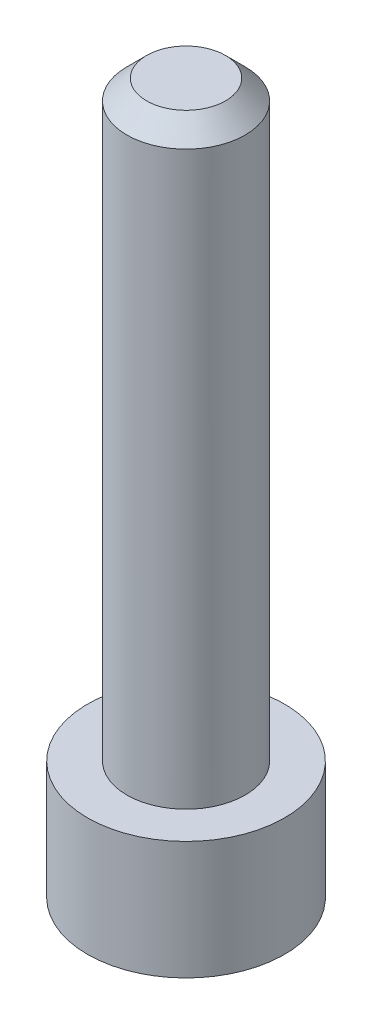
ISO-10303-21;
HEADER;
FILE_DESCRIPTION(('STEP AP214'),'2;1');
FILE_NAME('part.step','',(''),(''),'','','');
FILE_SCHEMA(('AUTOMOTIVE_DESIGN { 1 0 10303 214 1 1 1 1 }'));
ENDSEC;
DATA;
#1=APPLICATION_CONTEXT('core data for automotive mechanical design processes');
#2=APPLICATION_PROTOCOL_DEFINITION('international standard','automotive_design',2000,#1);
#3=PRODUCT_CONTEXT('',#1,'mechanical');
#4=PRODUCT('Part','Part','',(#3));
#5=PRODUCT_RELATED_PRODUCT_CATEGORY('part','',(#4));
#6=PRODUCT_DEFINITION_FORMATION('','',#4);
#7=PRODUCT_DEFINITION_CONTEXT('part definition',#1,'design');
#8=PRODUCT_DEFINITION('design','',#6,#7);
#9=PRODUCT_DEFINITION_SHAPE('','',#8);
#10=(LENGTH_UNIT() NAMED_UNIT(*) SI_UNIT(.MILLI.,.METRE.));
#11=(NAMED_UNIT(*) PLANE_ANGLE_UNIT() SI_UNIT($,.RADIAN.));
#12=(NAMED_UNIT(*) SI_UNIT($,.STERADIAN.) SOLID_ANGLE_UNIT());
#13=UNCERTAINTY_MEASURE_WITH_UNIT(LENGTH_MEASURE(1.E-05),#10,'distance_accuracy_value','');
#14=(GEOMETRIC_REPRESENTATION_CONTEXT(3) GLOBAL_UNCERTAINTY_ASSIGNED_CONTEXT((#13)) GLOBAL_UNIT_ASSIGNED_CONTEXT((#10,
#11,#12)) REPRESENTATION_CONTEXT('',''));
#15=CARTESIAN_POINT('',(0.,0.,0.));
#16=DIRECTION('',(0.,0.,1.));
#17=DIRECTION('',(1.,0.,0.));
#18=AXIS2_PLACEMENT_3D('',#15,#16,#17);
#19=CARTESIAN_POINT('',(0.,0.,0.));
#20=DIRECTION('',(0.,-1.,0.));
#21=DIRECTION('',(0.,0.,-1.));
#22=AXIS2_PLACEMENT_3D('',#19,#20,#21);
#23=PLANE('',#22);
#24=CARTESIAN_POINT('',(0.,0.,0.));
#25=DIRECTION('',(0.,-1.,0.));
#26=DIRECTION('',(0.,0.,-1.));
#27=AXIS2_PLACEMENT_3D('',#24,#25,#26);
#28=CIRCLE('',#27,0.999999999999999);
#29=CARTESIAN_POINT('',(0.,0.,-0.999999999999999));
#30=VERTEX_POINT('',#29);
#31=EDGE_CURVE('E35',#30,#30,#28,.F.);
#32=ORIENTED_EDGE('',*,*,#31,.T.);
#33=EDGE_LOOP('',(#32));
#34=FACE_BOUND('',#33,.T.);
#35=ADVANCED_FACE('F28',(#34),#23,.F.);
#36=CARTESIAN_POINT('',(0.,0.,0.));
#37=DIRECTION('',(0.,1.,0.));
#38=DIRECTION('',(0.,0.,1.));
#39=AXIS2_PLACEMENT_3D('',#36,#37,#38);
#40=CYLINDRICAL_SURFACE('',#39,1.5);
#41=CARTESIAN_POINT('',(0.,-0.500000000000003,0.));
#42=DIRECTION('',(0.,-1.,0.));
#43=DIRECTION('',(0.,0.,-1.));
#44=AXIS2_PLACEMENT_3D('',#41,#42,#43);
#45=CIRCLE('',#44,1.5);
#46=CARTESIAN_POINT('',(0.,-0.500000000000003,-1.5));
#47=VERTEX_POINT('',#46);
#48=EDGE_CURVE('E10',#47,#47,#45,.T.);
#49=ORIENTED_EDGE('',*,*,#48,.T.);
#50=EDGE_LOOP('',(#49));
#51=FACE_BOUND('',#50,.T.);
#52=CARTESIAN_POINT('',(0.,-15.,0.));
#53=DIRECTION('',(0.,1.,0.));
#54=DIRECTION('',(0.,0.,1.));
#55=AXIS2_PLACEMENT_3D('',#52,#53,#54);
#56=CIRCLE('',#55,1.5);
#57=CARTESIAN_POINT('',(0.,-15.,1.5));
#58=VERTEX_POINT('',#57);
#59=EDGE_CURVE('E39',#58,#58,#56,.T.);
#60=ORIENTED_EDGE('',*,*,#59,.T.);
#61=EDGE_LOOP('',(#60));
#62=FACE_BOUND('',#61,.T.);
#63=ADVANCED_FACE('F66',(#51,#62),#40,.T.);
#64=CARTESIAN_POINT('',(1.5,-15.,0.));
#65=DIRECTION('',(0.,-1.,0.));
#66=DIRECTION('',(0.,0.,-1.));
#67=AXIS2_PLACEMENT_3D('',#64,#65,#66);
#68=PLANE('',#67);
#69=ORIENTED_EDGE('',*,*,#59,.F.);
#70=EDGE_LOOP('',(#69));
#71=FACE_BOUND('',#70,.T.);
#72=CARTESIAN_POINT('',(0.,-15.,0.));
#73=DIRECTION('',(0.,1.,0.));
#74=DIRECTION('',(0.,0.,1.));
#75=AXIS2_PLACEMENT_3D('',#72,#73,#74);
#76=CIRCLE('',#75,2.5);
#77=CARTESIAN_POINT('',(0.,-15.,2.5));
#78=VERTEX_POINT('',#77);
#79=EDGE_CURVE('E43',#78,#78,#76,.T.);
#80=ORIENTED_EDGE('',*,*,#79,.T.);
#81=EDGE_LOOP('',(#80));
#82=FACE_BOUND('',#81,.T.);
#83=ADVANCED_FACE('F62',(#71,#82),#68,.F.);
#84=CARTESIAN_POINT('',(0.,0.,0.));
#85=DIRECTION('',(0.,1.,0.));
#86=DIRECTION('',(0.,0.,1.));
#87=AXIS2_PLACEMENT_3D('',#84,#85,#86);
#88=CYLINDRICAL_SURFACE('',#87,2.5);
#89=ORIENTED_EDGE('',*,*,#79,.F.);
#90=EDGE_LOOP('',(#89));
#91=FACE_BOUND('',#90,.T.);
#92=CARTESIAN_POINT('',(0.,-18.,0.));
#93=DIRECTION('',(0.,1.,0.));
#94=DIRECTION('',(0.,0.,1.));
#95=AXIS2_PLACEMENT_3D('',#92,#93,#94);
#96=CIRCLE('',#95,2.5);
#97=CARTESIAN_POINT('',(0.,-18.,2.5));
#98=VERTEX_POINT('',#97);
#99=EDGE_CURVE('E48',#98,#98,#96,.T.);
#100=ORIENTED_EDGE('',*,*,#99,.T.);
#101=EDGE_LOOP('',(#100));
#102=FACE_BOUND('',#101,.T.);
#103=ADVANCED_FACE('F52',(#91,#102),#88,.T.);
#104=CARTESIAN_POINT('',(2.5,-18.,0.));
#105=DIRECTION('',(0.,1.,0.));
#106=DIRECTION('',(0.,0.,1.));
#107=AXIS2_PLACEMENT_3D('',#104,#105,#106);
#108=PLANE('',#107);
#109=ORIENTED_EDGE('',*,*,#99,.F.);
#110=EDGE_LOOP('',(#109));
#111=FACE_BOUND('',#110,.T.);
#112=ADVANCED_FACE('F54',(#111),#108,.F.);
#113=CARTESIAN_POINT('',(0.,0.,0.));
#114=DIRECTION('',(0.,-1.,0.));
#115=DIRECTION('',(0.,0.,-1.));
#116=AXIS2_PLACEMENT_3D('',#113,#114,#115);
#117=CONICAL_SURFACE('',#116,0.999999999999999,0.785398163397447);
#118=ORIENTED_EDGE('',*,*,#48,.F.);
#119=EDGE_LOOP('',(#118));
#120=FACE_BOUND('',#119,.T.);
#121=ORIENTED_EDGE('',*,*,#31,.F.);
#122=EDGE_LOOP('',(#121));
#123=FACE_BOUND('',#122,.T.);
#124=ADVANCED_FACE('F30',(#120,#123),#117,.T.);
#125=CLOSED_SHELL('',(#35,#63,#83,#103,#112,#124));
#126=MANIFOLD_SOLID_BREP('B2',#125);
#127=ADVANCED_BREP_SHAPE_REPRESENTATION('',(#18,#126),#14);
#128=SHAPE_DEFINITION_REPRESENTATION(#9,#127);
ENDSEC;
END-ISO-10303-21;
